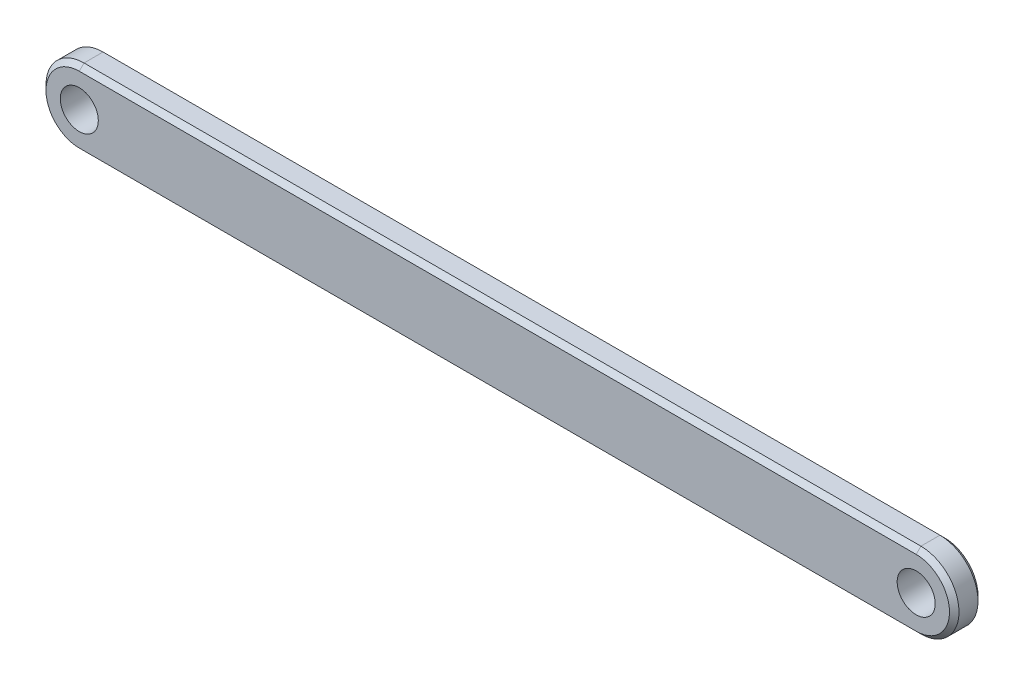
ISO-10303-21;
HEADER;
FILE_DESCRIPTION(('STEP AP214'),'2;1');
FILE_NAME('part.step','',(''),(''),'','','');
FILE_SCHEMA(('AUTOMOTIVE_DESIGN { 1 0 10303 214 1 1 1 1 }'));
ENDSEC;
DATA;
#1=APPLICATION_CONTEXT('core data for automotive mechanical design processes');
#2=APPLICATION_PROTOCOL_DEFINITION('international standard','automotive_design',2000,#1);
#3=PRODUCT_CONTEXT('',#1,'mechanical');
#4=PRODUCT('Part','Part','',(#3));
#5=PRODUCT_RELATED_PRODUCT_CATEGORY('part','',(#4));
#6=PRODUCT_DEFINITION_FORMATION('','',#4);
#7=PRODUCT_DEFINITION_CONTEXT('part definition',#1,'design');
#8=PRODUCT_DEFINITION('design','',#6,#7);
#9=PRODUCT_DEFINITION_SHAPE('','',#8);
#10=(LENGTH_UNIT() NAMED_UNIT(*) SI_UNIT(.MILLI.,.METRE.));
#11=(NAMED_UNIT(*) PLANE_ANGLE_UNIT() SI_UNIT($,.RADIAN.));
#12=(NAMED_UNIT(*) SI_UNIT($,.STERADIAN.) SOLID_ANGLE_UNIT());
#13=UNCERTAINTY_MEASURE_WITH_UNIT(LENGTH_MEASURE(1.E-05),#10,'distance_accuracy_value','');
#14=(GEOMETRIC_REPRESENTATION_CONTEXT(3) GLOBAL_UNCERTAINTY_ASSIGNED_CONTEXT((#13)) GLOBAL_UNIT_ASSIGNED_CONTEXT((#10,
#11,#12)) REPRESENTATION_CONTEXT('',''));
#15=CARTESIAN_POINT('',(0.,0.,0.));
#16=DIRECTION('',(0.,0.,1.));
#17=DIRECTION('',(1.,0.,0.));
#18=AXIS2_PLACEMENT_3D('',#15,#16,#17);
#19=CARTESIAN_POINT('',(-44.,0.,1.5));
#20=DIRECTION('',(0.,0.,1.));
#21=DIRECTION('',(1.,0.,0.));
#22=AXIS2_PLACEMENT_3D('',#19,#20,#21);
#23=PLANE('',#22);
#24=DIRECTION('',(1.,0.,0.));
#25=VECTOR('',#24,1.);
#26=CARTESIAN_POINT('',(44.,-3.49999999999998,1.5));
#27=LINE('',#26,#25);
#28=CARTESIAN_POINT('',(-44.,-3.5,1.5));
#29=VERTEX_POINT('',#28);
#30=CARTESIAN_POINT('',(44.,-3.49999999999998,1.5));
#31=VERTEX_POINT('',#30);
#32=EDGE_CURVE('E64',#29,#31,#27,.T.);
#33=ORIENTED_EDGE('',*,*,#32,.T.);
#34=CARTESIAN_POINT('',(44.,0.,1.5));
#35=DIRECTION('',(0.,0.,1.));
#36=DIRECTION('',(1.,0.,0.));
#37=AXIS2_PLACEMENT_3D('',#34,#35,#36);
#38=CIRCLE('',#37,3.5);
#39=CARTESIAN_POINT('',(44.,3.50000000000002,1.5));
#40=VERTEX_POINT('',#39);
#41=EDGE_CURVE('E11',#31,#40,#38,.T.);
#42=ORIENTED_EDGE('',*,*,#41,.T.);
#43=DIRECTION('',(-1.,0.,0.));
#44=VECTOR('',#43,1.);
#45=CARTESIAN_POINT('',(-44.,3.5,1.5));
#46=LINE('',#45,#44);
#47=CARTESIAN_POINT('',(-44.,3.5,1.5));
#48=VERTEX_POINT('',#47);
#49=EDGE_CURVE('E49',#40,#48,#46,.T.);
#50=ORIENTED_EDGE('',*,*,#49,.T.);
#51=CARTESIAN_POINT('',(-44.,0.,1.5));
#52=DIRECTION('',(0.,0.,1.));
#53=DIRECTION('',(1.,0.,0.));
#54=AXIS2_PLACEMENT_3D('',#51,#52,#53);
#55=CIRCLE('',#54,3.5);
#56=EDGE_CURVE('E232',#48,#29,#55,.T.);
#57=ORIENTED_EDGE('',*,*,#56,.T.);
#58=EDGE_LOOP('',(#33,#42,#50,#57));
#59=FACE_BOUND('',#58,.T.);
#60=CARTESIAN_POINT('',(-44.,0.,1.5));
#61=DIRECTION('',(0.,0.,1.));
#62=DIRECTION('',(1.,0.,0.));
#63=AXIS2_PLACEMENT_3D('',#60,#61,#62);
#64=CIRCLE('',#63,2.);
#65=CARTESIAN_POINT('',(-42.,0.,1.5));
#66=VERTEX_POINT('',#65);
#67=EDGE_CURVE('E190',#66,#66,#64,.T.);
#68=ORIENTED_EDGE('',*,*,#67,.F.);
#69=EDGE_LOOP('',(#68));
#70=FACE_BOUND('',#69,.T.);
#71=CARTESIAN_POINT('',(44.,0.,1.5));
#72=DIRECTION('',(0.,0.,1.));
#73=DIRECTION('',(1.,0.,0.));
#74=AXIS2_PLACEMENT_3D('',#71,#72,#73);
#75=CIRCLE('',#74,2.);
#76=CARTESIAN_POINT('',(46.,0.,1.5));
#77=VERTEX_POINT('',#76);
#78=EDGE_CURVE('E181',#77,#77,#75,.T.);
#79=ORIENTED_EDGE('',*,*,#78,.F.);
#80=EDGE_LOOP('',(#79));
#81=FACE_BOUND('',#80,.T.);
#82=ADVANCED_FACE('F39',(#59,#70,#81),#23,.T.);
#83=CARTESIAN_POINT('',(-44.,0.,-1.5));
#84=DIRECTION('',(0.,0.,1.));
#85=DIRECTION('',(1.,0.,0.));
#86=AXIS2_PLACEMENT_3D('',#83,#84,#85);
#87=PLANE('',#86);
#88=DIRECTION('',(1.,0.,0.));
#89=VECTOR('',#88,1.);
#90=CARTESIAN_POINT('',(-44.,3.5,-1.5));
#91=LINE('',#90,#89);
#92=CARTESIAN_POINT('',(-44.,3.5,-1.5));
#93=VERTEX_POINT('',#92);
#94=CARTESIAN_POINT('',(44.,3.50000000000002,-1.5));
#95=VERTEX_POINT('',#94);
#96=EDGE_CURVE('E212',#93,#95,#91,.T.);
#97=ORIENTED_EDGE('',*,*,#96,.T.);
#98=CARTESIAN_POINT('',(44.,0.,-1.5));
#99=DIRECTION('',(0.,0.,1.));
#100=DIRECTION('',(1.,0.,0.));
#101=AXIS2_PLACEMENT_3D('',#98,#99,#100);
#102=CIRCLE('',#101,3.5);
#103=CARTESIAN_POINT('',(44.,-3.49999999999998,-1.5));
#104=VERTEX_POINT('',#103);
#105=EDGE_CURVE('E121',#95,#104,#102,.F.);
#106=ORIENTED_EDGE('',*,*,#105,.T.);
#107=DIRECTION('',(-1.,0.,0.));
#108=VECTOR('',#107,1.);
#109=CARTESIAN_POINT('',(-44.,-3.5,-1.5));
#110=LINE('',#109,#108);
#111=CARTESIAN_POINT('',(-44.,-3.5,-1.5));
#112=VERTEX_POINT('',#111);
#113=EDGE_CURVE('E209',#104,#112,#110,.T.);
#114=ORIENTED_EDGE('',*,*,#113,.T.);
#115=CARTESIAN_POINT('',(-44.,0.,-1.5));
#116=DIRECTION('',(0.,0.,1.));
#117=DIRECTION('',(1.,0.,0.));
#118=AXIS2_PLACEMENT_3D('',#115,#116,#117);
#119=CIRCLE('',#118,3.5);
#120=EDGE_CURVE('E206',#112,#93,#119,.F.);
#121=ORIENTED_EDGE('',*,*,#120,.T.);
#122=EDGE_LOOP('',(#97,#106,#114,#121));
#123=FACE_BOUND('',#122,.T.);
#124=CARTESIAN_POINT('',(-44.,0.,-1.5));
#125=DIRECTION('',(0.,0.,1.));
#126=DIRECTION('',(1.,0.,0.));
#127=AXIS2_PLACEMENT_3D('',#124,#125,#126);
#128=CIRCLE('',#127,2.);
#129=CARTESIAN_POINT('',(-42.,0.,-1.5));
#130=VERTEX_POINT('',#129);
#131=EDGE_CURVE('E187',#130,#130,#128,.T.);
#132=ORIENTED_EDGE('',*,*,#131,.T.);
#133=EDGE_LOOP('',(#132));
#134=FACE_BOUND('',#133,.T.);
#135=CARTESIAN_POINT('',(44.,0.,-1.5));
#136=DIRECTION('',(0.,0.,1.));
#137=DIRECTION('',(1.,0.,0.));
#138=AXIS2_PLACEMENT_3D('',#135,#136,#137);
#139=CIRCLE('',#138,2.);
#140=CARTESIAN_POINT('',(46.,0.,-1.5));
#141=VERTEX_POINT('',#140);
#142=EDGE_CURVE('E174',#141,#141,#139,.T.);
#143=ORIENTED_EDGE('',*,*,#142,.T.);
#144=EDGE_LOOP('',(#143));
#145=FACE_BOUND('',#144,.T.);
#146=ADVANCED_FACE('F264',(#123,#134,#145),#87,.F.);
#147=CARTESIAN_POINT('',(-44.,0.,1.5));
#148=DIRECTION('',(0.,0.,-1.));
#149=DIRECTION('',(-1.,0.,0.));
#150=AXIS2_PLACEMENT_3D('',#147,#148,#149);
#151=CYLINDRICAL_SURFACE('',#150,4.);
#152=DIRECTION('',(0.,0.,-1.));
#153=VECTOR('',#152,1.);
#154=CARTESIAN_POINT('',(-44.,4.,1.5));
#155=LINE('',#154,#153);
#156=CARTESIAN_POINT('',(-44.,4.,1.));
#157=VERTEX_POINT('',#156);
#158=CARTESIAN_POINT('',(-44.,4.,-1.00000000000002));
#159=VERTEX_POINT('',#158);
#160=EDGE_CURVE('E115',#157,#159,#155,.T.);
#161=ORIENTED_EDGE('',*,*,#160,.T.);
#162=CARTESIAN_POINT('',(-44.,0.,-1.00000000000002));
#163=DIRECTION('',(0.,0.,1.));
#164=DIRECTION('',(1.,0.,0.));
#165=AXIS2_PLACEMENT_3D('',#162,#163,#164);
#166=CIRCLE('',#165,4.);
#167=CARTESIAN_POINT('',(-44.,-4.,-1.00000000000002));
#168=VERTEX_POINT('',#167);
#169=EDGE_CURVE('E229',#159,#168,#166,.T.);
#170=ORIENTED_EDGE('',*,*,#169,.T.);
#171=DIRECTION('',(0.,0.,-1.));
#172=VECTOR('',#171,1.);
#173=CARTESIAN_POINT('',(-44.,-4.,1.5));
#174=LINE('',#173,#172);
#175=CARTESIAN_POINT('',(-44.,-4.,1.));
#176=VERTEX_POINT('',#175);
#177=EDGE_CURVE('E139',#176,#168,#174,.T.);
#178=ORIENTED_EDGE('',*,*,#177,.F.);
#179=CARTESIAN_POINT('',(-44.,0.,1.));
#180=DIRECTION('',(0.,0.,1.));
#181=DIRECTION('',(1.,0.,0.));
#182=AXIS2_PLACEMENT_3D('',#179,#180,#181);
#183=CIRCLE('',#182,4.);
#184=EDGE_CURVE('E226',#176,#157,#183,.F.);
#185=ORIENTED_EDGE('',*,*,#184,.T.);
#186=EDGE_LOOP('',(#161,#170,#178,#185));
#187=FACE_BOUND('',#186,.T.);
#188=ADVANCED_FACE('F246',(#187),#151,.T.);
#189=CARTESIAN_POINT('',(-44.,-4.,1.5));
#190=DIRECTION('',(0.,1.,0.));
#191=DIRECTION('',(-1.,0.,0.));
#192=AXIS2_PLACEMENT_3D('',#189,#190,#191);
#193=PLANE('',#192);
#194=ORIENTED_EDGE('',*,*,#177,.T.);
#195=DIRECTION('',(1.,0.,0.));
#196=VECTOR('',#195,1.);
#197=CARTESIAN_POINT('',(-44.,-4.,-1.00000000000002));
#198=LINE('',#197,#196);
#199=CARTESIAN_POINT('',(44.,-3.99999999999998,-1.00000000000002));
#200=VERTEX_POINT('',#199);
#201=EDGE_CURVE('E223',#168,#200,#198,.T.);
#202=ORIENTED_EDGE('',*,*,#201,.T.);
#203=DIRECTION('',(0.,0.,-1.));
#204=VECTOR('',#203,1.);
#205=CARTESIAN_POINT('',(44.,-3.99999999999998,1.5));
#206=LINE('',#205,#204);
#207=CARTESIAN_POINT('',(44.,-3.99999999999998,1.));
#208=VERTEX_POINT('',#207);
#209=EDGE_CURVE('E133',#208,#200,#206,.T.);
#210=ORIENTED_EDGE('',*,*,#209,.F.);
#211=DIRECTION('',(-1.,0.,0.));
#212=VECTOR('',#211,1.);
#213=CARTESIAN_POINT('',(-44.,-4.,1.));
#214=LINE('',#213,#212);
#215=EDGE_CURVE('E220',#208,#176,#214,.T.);
#216=ORIENTED_EDGE('',*,*,#215,.T.);
#217=EDGE_LOOP('',(#194,#202,#210,#216));
#218=FACE_BOUND('',#217,.T.);
#219=ADVANCED_FACE('F244',(#218),#193,.F.);
#220=CARTESIAN_POINT('',(44.,0.,1.5));
#221=DIRECTION('',(0.,0.,-1.));
#222=DIRECTION('',(-1.,0.,0.));
#223=AXIS2_PLACEMENT_3D('',#220,#221,#222);
#224=CYLINDRICAL_SURFACE('',#223,4.);
#225=ORIENTED_EDGE('',*,*,#209,.T.);
#226=CARTESIAN_POINT('',(44.,0.,-1.00000000000002));
#227=DIRECTION('',(0.,0.,1.));
#228=DIRECTION('',(1.,0.,0.));
#229=AXIS2_PLACEMENT_3D('',#226,#227,#228);
#230=CIRCLE('',#229,4.);
#231=CARTESIAN_POINT('',(44.,4.00000000000002,-1.00000000000002));
#232=VERTEX_POINT('',#231);
#233=EDGE_CURVE('E131',#200,#232,#230,.T.);
#234=ORIENTED_EDGE('',*,*,#233,.T.);
#235=DIRECTION('',(0.,0.,-1.));
#236=VECTOR('',#235,1.);
#237=CARTESIAN_POINT('',(44.,4.00000000000002,1.5));
#238=LINE('',#237,#236);
#239=CARTESIAN_POINT('',(44.,4.00000000000002,1.));
#240=VERTEX_POINT('',#239);
#241=EDGE_CURVE('E113',#240,#232,#238,.T.);
#242=ORIENTED_EDGE('',*,*,#241,.F.);
#243=CARTESIAN_POINT('',(44.,0.,1.));
#244=DIRECTION('',(0.,0.,1.));
#245=DIRECTION('',(1.,0.,0.));
#246=AXIS2_PLACEMENT_3D('',#243,#244,#245);
#247=CIRCLE('',#246,4.);
#248=EDGE_CURVE('E128',#240,#208,#247,.F.);
#249=ORIENTED_EDGE('',*,*,#248,.T.);
#250=EDGE_LOOP('',(#225,#234,#242,#249));
#251=FACE_BOUND('',#250,.T.);
#252=ADVANCED_FACE('F127',(#251),#224,.T.);
#253=CARTESIAN_POINT('',(-44.,4.,1.5));
#254=DIRECTION('',(0.,-1.,0.));
#255=DIRECTION('',(1.,0.,0.));
#256=AXIS2_PLACEMENT_3D('',#253,#254,#255);
#257=PLANE('',#256);
#258=ORIENTED_EDGE('',*,*,#241,.T.);
#259=DIRECTION('',(-1.,0.,0.));
#260=VECTOR('',#259,1.);
#261=CARTESIAN_POINT('',(-44.,4.,-1.00000000000002));
#262=LINE('',#261,#260);
#263=EDGE_CURVE('E120',#232,#159,#262,.T.);
#264=ORIENTED_EDGE('',*,*,#263,.T.);
#265=ORIENTED_EDGE('',*,*,#160,.F.);
#266=DIRECTION('',(1.,0.,0.));
#267=VECTOR('',#266,1.);
#268=CARTESIAN_POINT('',(44.,4.00000000000002,1.));
#269=LINE('',#268,#267);
#270=EDGE_CURVE('E110',#157,#240,#269,.T.);
#271=ORIENTED_EDGE('',*,*,#270,.T.);
#272=EDGE_LOOP('',(#258,#264,#265,#271));
#273=FACE_BOUND('',#272,.T.);
#274=ADVANCED_FACE('F112',(#273),#257,.F.);
#275=CARTESIAN_POINT('',(-44.,0.,1.5));
#276=DIRECTION('',(0.,0.,-1.));
#277=DIRECTION('',(-1.,0.,0.));
#278=AXIS2_PLACEMENT_3D('',#275,#276,#277);
#279=CYLINDRICAL_SURFACE('',#278,2.);
#280=ORIENTED_EDGE('',*,*,#67,.T.);
#281=EDGE_LOOP('',(#280));
#282=FACE_BOUND('',#281,.T.);
#283=ORIENTED_EDGE('',*,*,#131,.F.);
#284=EDGE_LOOP('',(#283));
#285=FACE_BOUND('',#284,.T.);
#286=ADVANCED_FACE('F272',(#282,#285),#279,.F.);
#287=CARTESIAN_POINT('',(44.,0.,1.5));
#288=DIRECTION('',(0.,0.,-1.));
#289=DIRECTION('',(-1.,0.,0.));
#290=AXIS2_PLACEMENT_3D('',#287,#288,#289);
#291=CYLINDRICAL_SURFACE('',#290,2.);
#292=ORIENTED_EDGE('',*,*,#78,.T.);
#293=EDGE_LOOP('',(#292));
#294=FACE_BOUND('',#293,.T.);
#295=ORIENTED_EDGE('',*,*,#142,.F.);
#296=EDGE_LOOP('',(#295));
#297=FACE_BOUND('',#296,.T.);
#298=ADVANCED_FACE('F304',(#294,#297),#291,.F.);
#299=CARTESIAN_POINT('',(-44.,0.,-1.00000000000002));
#300=DIRECTION('',(0.,0.,1.));
#301=DIRECTION('',(1.,0.,0.));
#302=AXIS2_PLACEMENT_3D('',#299,#300,#301);
#303=CONICAL_SURFACE('',#302,4.,0.785398163397466);
#304=DIRECTION('',(0.,0.70710678118656,0.707106781186535));
#305=VECTOR('',#304,1.);
#306=CARTESIAN_POINT('',(-44.,3.5,-1.5));
#307=LINE('',#306,#305);
#308=EDGE_CURVE('E164',#93,#159,#307,.T.);
#309=ORIENTED_EDGE('',*,*,#308,.F.);
#310=ORIENTED_EDGE('',*,*,#120,.F.);
#311=DIRECTION('',(0.,0.70710678118656,-0.707106781186535));
#312=VECTOR('',#311,1.);
#313=CARTESIAN_POINT('',(-44.,-4.,-1.00000000000002));
#314=LINE('',#313,#312);
#315=EDGE_CURVE('E148',#168,#112,#314,.T.);
#316=ORIENTED_EDGE('',*,*,#315,.F.);
#317=ORIENTED_EDGE('',*,*,#169,.F.);
#318=EDGE_LOOP('',(#309,#310,#316,#317));
#319=FACE_BOUND('',#318,.T.);
#320=ADVANCED_FACE('F249',(#319),#303,.T.);
#321=CARTESIAN_POINT('',(-44.,-4.,-1.00000000000002));
#322=DIRECTION('',(0.,0.707106781186535,0.70710678118656));
#323=DIRECTION('',(1.,0.,0.));
#324=AXIS2_PLACEMENT_3D('',#321,#322,#323);
#325=PLANE('',#324);
#326=ORIENTED_EDGE('',*,*,#315,.T.);
#327=ORIENTED_EDGE('',*,*,#113,.F.);
#328=DIRECTION('',(0.,0.70710678118656,-0.707106781186535));
#329=VECTOR('',#328,1.);
#330=CARTESIAN_POINT('',(44.,-3.99999999999998,-1.00000000000002));
#331=LINE('',#330,#329);
#332=EDGE_CURVE('E157',#200,#104,#331,.T.);
#333=ORIENTED_EDGE('',*,*,#332,.F.);
#334=ORIENTED_EDGE('',*,*,#201,.F.);
#335=EDGE_LOOP('',(#326,#327,#333,#334));
#336=FACE_BOUND('',#335,.T.);
#337=ADVANCED_FACE('F252',(#336),#325,.F.);
#338=CARTESIAN_POINT('',(-44.,4.,-1.00000000000002));
#339=DIRECTION('',(0.,-0.707106781186535,0.70710678118656));
#340=DIRECTION('',(-1.,0.,0.));
#341=AXIS2_PLACEMENT_3D('',#338,#339,#340);
#342=PLANE('',#341);
#343=ORIENTED_EDGE('',*,*,#308,.T.);
#344=ORIENTED_EDGE('',*,*,#263,.F.);
#345=DIRECTION('',(0.,0.70710678118656,0.707106781186535));
#346=VECTOR('',#345,1.);
#347=CARTESIAN_POINT('',(44.,3.50000000000002,-1.5));
#348=LINE('',#347,#346);
#349=EDGE_CURVE('E153',#95,#232,#348,.T.);
#350=ORIENTED_EDGE('',*,*,#349,.F.);
#351=ORIENTED_EDGE('',*,*,#96,.F.);
#352=EDGE_LOOP('',(#343,#344,#350,#351));
#353=FACE_BOUND('',#352,.T.);
#354=ADVANCED_FACE('F255',(#353),#342,.F.);
#355=CARTESIAN_POINT('',(44.,0.,-1.00000000000002));
#356=DIRECTION('',(0.,0.,1.));
#357=DIRECTION('',(1.,0.,0.));
#358=AXIS2_PLACEMENT_3D('',#355,#356,#357);
#359=CONICAL_SURFACE('',#358,4.,0.785398163397466);
#360=ORIENTED_EDGE('',*,*,#332,.T.);
#361=ORIENTED_EDGE('',*,*,#105,.F.);
#362=ORIENTED_EDGE('',*,*,#349,.T.);
#363=ORIENTED_EDGE('',*,*,#233,.F.);
#364=EDGE_LOOP('',(#360,#361,#362,#363));
#365=FACE_BOUND('',#364,.T.);
#366=ADVANCED_FACE('F253',(#365),#359,.T.);
#367=CARTESIAN_POINT('',(-44.,0.,1.5));
#368=DIRECTION('',(0.,0.,-1.));
#369=DIRECTION('',(-1.,0.,0.));
#370=AXIS2_PLACEMENT_3D('',#367,#368,#369);
#371=CONICAL_SURFACE('',#370,3.5,0.785398163397452);
#372=DIRECTION('',(0.,-0.70710678118655,0.707106781186545));
#373=VECTOR('',#372,1.);
#374=CARTESIAN_POINT('',(-44.,4.,1.));
#375=LINE('',#374,#373);
#376=EDGE_CURVE('E145',#157,#48,#375,.T.);
#377=ORIENTED_EDGE('',*,*,#376,.F.);
#378=ORIENTED_EDGE('',*,*,#184,.F.);
#379=DIRECTION('',(0.,-0.70710678118655,-0.707106781186545));
#380=VECTOR('',#379,1.);
#381=CARTESIAN_POINT('',(-44.,-3.5,1.5));
#382=LINE('',#381,#380);
#383=EDGE_CURVE('E43',#29,#176,#382,.T.);
#384=ORIENTED_EDGE('',*,*,#383,.F.);
#385=ORIENTED_EDGE('',*,*,#56,.F.);
#386=EDGE_LOOP('',(#377,#378,#384,#385));
#387=FACE_BOUND('',#386,.T.);
#388=ADVANCED_FACE('F41',(#387),#371,.T.);
#389=CARTESIAN_POINT('',(-44.,-3.5,1.5));
#390=DIRECTION('',(0.,-0.707106781186545,0.70710678118655));
#391=DIRECTION('',(-1.,0.,0.));
#392=AXIS2_PLACEMENT_3D('',#389,#390,#391);
#393=PLANE('',#392);
#394=ORIENTED_EDGE('',*,*,#383,.T.);
#395=ORIENTED_EDGE('',*,*,#215,.F.);
#396=DIRECTION('',(0.,-0.70710678118655,-0.707106781186545));
#397=VECTOR('',#396,1.);
#398=CARTESIAN_POINT('',(44.,-3.49999999999998,1.5));
#399=LINE('',#398,#397);
#400=EDGE_CURVE('E136',#31,#208,#399,.T.);
#401=ORIENTED_EDGE('',*,*,#400,.F.);
#402=ORIENTED_EDGE('',*,*,#32,.F.);
#403=EDGE_LOOP('',(#394,#395,#401,#402));
#404=FACE_BOUND('',#403,.T.);
#405=ADVANCED_FACE('F241',(#404),#393,.T.);
#406=CARTESIAN_POINT('',(-44.,3.5,1.5));
#407=DIRECTION('',(0.,0.707106781186545,0.70710678118655));
#408=DIRECTION('',(1.,0.,0.));
#409=AXIS2_PLACEMENT_3D('',#406,#407,#408);
#410=PLANE('',#409);
#411=ORIENTED_EDGE('',*,*,#376,.T.);
#412=ORIENTED_EDGE('',*,*,#49,.F.);
#413=DIRECTION('',(0.,-0.70710678118655,0.707106781186545));
#414=VECTOR('',#413,1.);
#415=CARTESIAN_POINT('',(44.,4.00000000000002,1.));
#416=LINE('',#415,#414);
#417=EDGE_CURVE('E57',#240,#40,#416,.T.);
#418=ORIENTED_EDGE('',*,*,#417,.F.);
#419=ORIENTED_EDGE('',*,*,#270,.F.);
#420=EDGE_LOOP('',(#411,#412,#418,#419));
#421=FACE_BOUND('',#420,.T.);
#422=ADVANCED_FACE('F141',(#421),#410,.T.);
#423=CARTESIAN_POINT('',(44.,0.,1.5));
#424=DIRECTION('',(0.,0.,-1.));
#425=DIRECTION('',(-1.,0.,0.));
#426=AXIS2_PLACEMENT_3D('',#423,#424,#425);
#427=CONICAL_SURFACE('',#426,3.5,0.785398163397452);
#428=ORIENTED_EDGE('',*,*,#400,.T.);
#429=ORIENTED_EDGE('',*,*,#248,.F.);
#430=ORIENTED_EDGE('',*,*,#417,.T.);
#431=ORIENTED_EDGE('',*,*,#41,.F.);
#432=EDGE_LOOP('',(#428,#429,#430,#431));
#433=FACE_BOUND('',#432,.T.);
#434=ADVANCED_FACE('F135',(#433),#427,.T.);
#435=CLOSED_SHELL('',(#82,#146,#188,#219,#252,#274,#286,#298,#320,#337,#354,#366,#388,#405,#422,#434));
#436=MANIFOLD_SOLID_BREP('B2',#435);
#437=ADVANCED_BREP_SHAPE_REPRESENTATION('',(#18,#436),#14);
#438=SHAPE_DEFINITION_REPRESENTATION(#9,#437);
ENDSEC;
END-ISO-10303-21;
